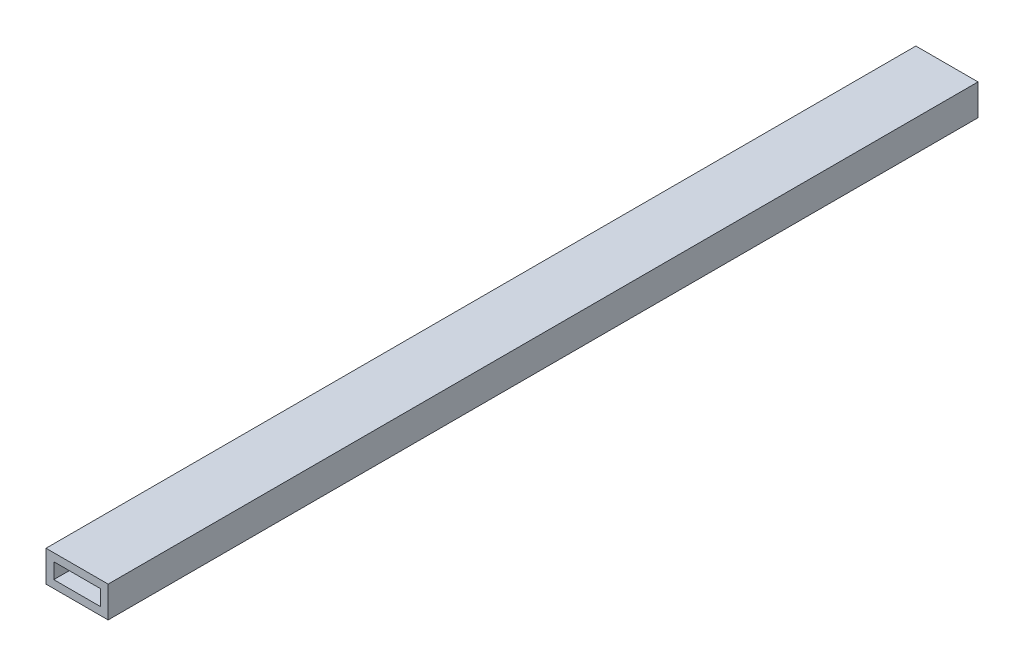
ISO-10303-21;
HEADER;
FILE_DESCRIPTION(('STEP AP214'),'2;1');
FILE_NAME('part.step','',(''),(''),'','','');
FILE_SCHEMA(('AUTOMOTIVE_DESIGN { 1 0 10303 214 1 1 1 1 }'));
ENDSEC;
DATA;
#1=APPLICATION_CONTEXT('core data for automotive mechanical design processes');
#2=APPLICATION_PROTOCOL_DEFINITION('international standard','automotive_design',2000,#1);
#3=PRODUCT_CONTEXT('',#1,'mechanical');
#4=PRODUCT('Part','Part','',(#3));
#5=PRODUCT_RELATED_PRODUCT_CATEGORY('part','',(#4));
#6=PRODUCT_DEFINITION_FORMATION('','',#4);
#7=PRODUCT_DEFINITION_CONTEXT('part definition',#1,'design');
#8=PRODUCT_DEFINITION('design','',#6,#7);
#9=PRODUCT_DEFINITION_SHAPE('','',#8);
#10=(LENGTH_UNIT() NAMED_UNIT(*) SI_UNIT(.MILLI.,.METRE.));
#11=(NAMED_UNIT(*) PLANE_ANGLE_UNIT() SI_UNIT($,.RADIAN.));
#12=(NAMED_UNIT(*) SI_UNIT($,.STERADIAN.) SOLID_ANGLE_UNIT());
#13=UNCERTAINTY_MEASURE_WITH_UNIT(LENGTH_MEASURE(1.E-05),#10,'distance_accuracy_value','');
#14=(GEOMETRIC_REPRESENTATION_CONTEXT(3) GLOBAL_UNCERTAINTY_ASSIGNED_CONTEXT((#13)) GLOBAL_UNIT_ASSIGNED_CONTEXT((#10,
#11,#12)) REPRESENTATION_CONTEXT('',''));
#15=CARTESIAN_POINT('',(0.,0.,0.));
#16=DIRECTION('',(0.,0.,1.));
#17=DIRECTION('',(1.,0.,0.));
#18=AXIS2_PLACEMENT_3D('',#15,#16,#17);
#19=CARTESIAN_POINT('',(0.,0.,355.6));
#20=DIRECTION('',(0.,0.,-1.));
#21=DIRECTION('',(-1.,0.,0.));
#22=AXIS2_PLACEMENT_3D('',#19,#20,#21);
#23=PLANE('',#22);
#24=DIRECTION('',(0.,-1.,0.));
#25=VECTOR('',#24,1.);
#26=CARTESIAN_POINT('',(0.,0.,355.6));
#27=LINE('',#26,#25);
#28=CARTESIAN_POINT('',(0.,12.7,355.6));
#29=VERTEX_POINT('',#28);
#30=CARTESIAN_POINT('',(0.,0.,355.6));
#31=VERTEX_POINT('',#30);
#32=EDGE_CURVE('E164',#29,#31,#27,.T.);
#33=ORIENTED_EDGE('',*,*,#32,.T.);
#34=DIRECTION('',(1.,0.,0.));
#35=VECTOR('',#34,1.);
#36=CARTESIAN_POINT('',(0.,0.,355.6));
#37=LINE('',#36,#35);
#38=CARTESIAN_POINT('',(25.4,0.,355.6));
#39=VERTEX_POINT('',#38);
#40=EDGE_CURVE('E168',#31,#39,#37,.T.);
#41=ORIENTED_EDGE('',*,*,#40,.T.);
#42=DIRECTION('',(0.,1.,0.));
#43=VECTOR('',#42,1.);
#44=CARTESIAN_POINT('',(25.4,0.,355.6));
#45=LINE('',#44,#43);
#46=CARTESIAN_POINT('',(25.4,12.7,355.6));
#47=VERTEX_POINT('',#46);
#48=EDGE_CURVE('E172',#39,#47,#45,.T.);
#49=ORIENTED_EDGE('',*,*,#48,.T.);
#50=DIRECTION('',(-1.,0.,0.));
#51=VECTOR('',#50,1.);
#52=CARTESIAN_POINT('',(0.,12.7,355.6));
#53=LINE('',#52,#51);
#54=EDGE_CURVE('E174',#47,#29,#53,.T.);
#55=ORIENTED_EDGE('',*,*,#54,.T.);
#56=EDGE_LOOP('',(#33,#41,#49,#55));
#57=FACE_BOUND('',#56,.T.);
#58=DIRECTION('',(0.,-1.,0.));
#59=VECTOR('',#58,1.);
#60=CARTESIAN_POINT('',(3.175,3.175,355.6));
#61=LINE('',#60,#59);
#62=CARTESIAN_POINT('',(3.175,9.525,355.6));
#63=VERTEX_POINT('',#62);
#64=CARTESIAN_POINT('',(3.175,3.175,355.6));
#65=VERTEX_POINT('',#64);
#66=EDGE_CURVE('E116',#63,#65,#61,.T.);
#67=ORIENTED_EDGE('',*,*,#66,.F.);
#68=DIRECTION('',(-1.,0.,0.));
#69=VECTOR('',#68,1.);
#70=CARTESIAN_POINT('',(3.175,9.525,355.6));
#71=LINE('',#70,#69);
#72=CARTESIAN_POINT('',(22.225,9.525,355.6));
#73=VERTEX_POINT('',#72);
#74=EDGE_CURVE('E142',#73,#63,#71,.T.);
#75=ORIENTED_EDGE('',*,*,#74,.F.);
#76=DIRECTION('',(0.,1.,0.));
#77=VECTOR('',#76,1.);
#78=CARTESIAN_POINT('',(22.225,3.175,355.6));
#79=LINE('',#78,#77);
#80=CARTESIAN_POINT('',(22.225,3.175,355.6));
#81=VERTEX_POINT('',#80);
#82=EDGE_CURVE('E138',#81,#73,#79,.T.);
#83=ORIENTED_EDGE('',*,*,#82,.F.);
#84=DIRECTION('',(1.,0.,0.));
#85=VECTOR('',#84,1.);
#86=CARTESIAN_POINT('',(3.175,3.175,355.6));
#87=LINE('',#86,#85);
#88=EDGE_CURVE('E125',#65,#81,#87,.T.);
#89=ORIENTED_EDGE('',*,*,#88,.F.);
#90=EDGE_LOOP('',(#67,#75,#83,#89));
#91=FACE_BOUND('',#90,.T.);
#92=ADVANCED_FACE('F38',(#57,#91),#23,.F.);
#93=CARTESIAN_POINT('',(0.,0.,0.));
#94=DIRECTION('',(0.,0.,-1.));
#95=DIRECTION('',(-1.,0.,0.));
#96=AXIS2_PLACEMENT_3D('',#93,#94,#95);
#97=PLANE('',#96);
#98=DIRECTION('',(0.,-1.,0.));
#99=VECTOR('',#98,1.);
#100=CARTESIAN_POINT('',(0.,0.,0.));
#101=LINE('',#100,#99);
#102=CARTESIAN_POINT('',(0.,12.7,0.));
#103=VERTEX_POINT('',#102);
#104=CARTESIAN_POINT('',(0.,0.,0.));
#105=VERTEX_POINT('',#104);
#106=EDGE_CURVE('E134',#103,#105,#101,.T.);
#107=ORIENTED_EDGE('',*,*,#106,.F.);
#108=DIRECTION('',(-1.,0.,0.));
#109=VECTOR('',#108,1.);
#110=CARTESIAN_POINT('',(0.,12.7,0.));
#111=LINE('',#110,#109);
#112=CARTESIAN_POINT('',(25.4,12.7,0.));
#113=VERTEX_POINT('',#112);
#114=EDGE_CURVE('E169',#113,#103,#111,.T.);
#115=ORIENTED_EDGE('',*,*,#114,.F.);
#116=DIRECTION('',(0.,1.,0.));
#117=VECTOR('',#116,1.);
#118=CARTESIAN_POINT('',(25.4,0.,0.));
#119=LINE('',#118,#117);
#120=CARTESIAN_POINT('',(25.4,0.,0.));
#121=VERTEX_POINT('',#120);
#122=EDGE_CURVE('E184',#121,#113,#119,.T.);
#123=ORIENTED_EDGE('',*,*,#122,.F.);
#124=DIRECTION('',(1.,0.,0.));
#125=VECTOR('',#124,1.);
#126=CARTESIAN_POINT('',(0.,0.,0.));
#127=LINE('',#126,#125);
#128=EDGE_CURVE('E181',#105,#121,#127,.T.);
#129=ORIENTED_EDGE('',*,*,#128,.F.);
#130=EDGE_LOOP('',(#107,#115,#123,#129));
#131=FACE_BOUND('',#130,.T.);
#132=DIRECTION('',(-1.,0.,0.));
#133=VECTOR('',#132,1.);
#134=CARTESIAN_POINT('',(3.175,9.525,0.));
#135=LINE('',#134,#133);
#136=CARTESIAN_POINT('',(22.225,9.525,0.));
#137=VERTEX_POINT('',#136);
#138=CARTESIAN_POINT('',(3.175,9.525,0.));
#139=VERTEX_POINT('',#138);
#140=EDGE_CURVE('E126',#137,#139,#135,.T.);
#141=ORIENTED_EDGE('',*,*,#140,.T.);
#142=DIRECTION('',(0.,-1.,0.));
#143=VECTOR('',#142,1.);
#144=CARTESIAN_POINT('',(3.175,3.175,0.));
#145=LINE('',#144,#143);
#146=CARTESIAN_POINT('',(3.175,3.175,0.));
#147=VERTEX_POINT('',#146);
#148=EDGE_CURVE('E65',#139,#147,#145,.T.);
#149=ORIENTED_EDGE('',*,*,#148,.T.);
#150=DIRECTION('',(1.,0.,0.));
#151=VECTOR('',#150,1.);
#152=CARTESIAN_POINT('',(3.175,3.175,0.));
#153=LINE('',#152,#151);
#154=CARTESIAN_POINT('',(22.225,3.175,0.));
#155=VERTEX_POINT('',#154);
#156=EDGE_CURVE('E132',#147,#155,#153,.T.);
#157=ORIENTED_EDGE('',*,*,#156,.T.);
#158=DIRECTION('',(0.,1.,0.));
#159=VECTOR('',#158,1.);
#160=CARTESIAN_POINT('',(22.225,3.175,0.));
#161=LINE('',#160,#159);
#162=EDGE_CURVE('E151',#155,#137,#161,.T.);
#163=ORIENTED_EDGE('',*,*,#162,.T.);
#164=EDGE_LOOP('',(#141,#149,#157,#163));
#165=FACE_BOUND('',#164,.T.);
#166=ADVANCED_FACE('F207',(#131,#165),#97,.T.);
#167=CARTESIAN_POINT('',(0.,0.,355.6));
#168=DIRECTION('',(1.,0.,0.));
#169=DIRECTION('',(0.,0.,-1.));
#170=AXIS2_PLACEMENT_3D('',#167,#168,#169);
#171=PLANE('',#170);
#172=ORIENTED_EDGE('',*,*,#106,.T.);
#173=DIRECTION('',(0.,0.,-1.));
#174=VECTOR('',#173,1.);
#175=CARTESIAN_POINT('',(0.,0.,355.6));
#176=LINE('',#175,#174);
#177=EDGE_CURVE('E11',#31,#105,#176,.T.);
#178=ORIENTED_EDGE('',*,*,#177,.F.);
#179=ORIENTED_EDGE('',*,*,#32,.F.);
#180=DIRECTION('',(0.,0.,-1.));
#181=VECTOR('',#180,1.);
#182=CARTESIAN_POINT('',(0.,12.7,355.6));
#183=LINE('',#182,#181);
#184=EDGE_CURVE('E177',#29,#103,#183,.T.);
#185=ORIENTED_EDGE('',*,*,#184,.T.);
#186=EDGE_LOOP('',(#172,#178,#179,#185));
#187=FACE_BOUND('',#186,.T.);
#188=ADVANCED_FACE('F40',(#187),#171,.F.);
#189=CARTESIAN_POINT('',(0.,0.,355.6));
#190=DIRECTION('',(0.,1.,0.));
#191=DIRECTION('',(0.,0.,1.));
#192=AXIS2_PLACEMENT_3D('',#189,#190,#191);
#193=PLANE('',#192);
#194=ORIENTED_EDGE('',*,*,#128,.T.);
#195=DIRECTION('',(0.,0.,-1.));
#196=VECTOR('',#195,1.);
#197=CARTESIAN_POINT('',(25.4,0.,355.6));
#198=LINE('',#197,#196);
#199=EDGE_CURVE('E47',#39,#121,#198,.T.);
#200=ORIENTED_EDGE('',*,*,#199,.F.);
#201=ORIENTED_EDGE('',*,*,#40,.F.);
#202=ORIENTED_EDGE('',*,*,#177,.T.);
#203=EDGE_LOOP('',(#194,#200,#201,#202));
#204=FACE_BOUND('',#203,.T.);
#205=ADVANCED_FACE('F217',(#204),#193,.F.);
#206=CARTESIAN_POINT('',(25.4,0.,355.6));
#207=DIRECTION('',(-1.,0.,0.));
#208=DIRECTION('',(0.,0.,1.));
#209=AXIS2_PLACEMENT_3D('',#206,#207,#208);
#210=PLANE('',#209);
#211=ORIENTED_EDGE('',*,*,#122,.T.);
#212=DIRECTION('',(0.,0.,-1.));
#213=VECTOR('',#212,1.);
#214=CARTESIAN_POINT('',(25.4,12.7,355.6));
#215=LINE('',#214,#213);
#216=EDGE_CURVE('E192',#47,#113,#215,.T.);
#217=ORIENTED_EDGE('',*,*,#216,.F.);
#218=ORIENTED_EDGE('',*,*,#48,.F.);
#219=ORIENTED_EDGE('',*,*,#199,.T.);
#220=EDGE_LOOP('',(#211,#217,#218,#219));
#221=FACE_BOUND('',#220,.T.);
#222=ADVANCED_FACE('F201',(#221),#210,.F.);
#223=CARTESIAN_POINT('',(0.,12.7,355.6));
#224=DIRECTION('',(0.,-1.,0.));
#225=DIRECTION('',(0.,0.,-1.));
#226=AXIS2_PLACEMENT_3D('',#223,#224,#225);
#227=PLANE('',#226);
#228=ORIENTED_EDGE('',*,*,#114,.T.);
#229=ORIENTED_EDGE('',*,*,#184,.F.);
#230=ORIENTED_EDGE('',*,*,#54,.F.);
#231=ORIENTED_EDGE('',*,*,#216,.T.);
#232=EDGE_LOOP('',(#228,#229,#230,#231));
#233=FACE_BOUND('',#232,.T.);
#234=ADVANCED_FACE('F211',(#233),#227,.F.);
#235=CARTESIAN_POINT('',(3.175,3.175,355.6));
#236=DIRECTION('',(1.,0.,0.));
#237=DIRECTION('',(0.,0.,-1.));
#238=AXIS2_PLACEMENT_3D('',#235,#236,#237);
#239=PLANE('',#238);
#240=ORIENTED_EDGE('',*,*,#148,.F.);
#241=DIRECTION('',(0.,0.,-1.));
#242=VECTOR('',#241,1.);
#243=CARTESIAN_POINT('',(3.175,9.525,355.6));
#244=LINE('',#243,#242);
#245=EDGE_CURVE('E120',#63,#139,#244,.T.);
#246=ORIENTED_EDGE('',*,*,#245,.F.);
#247=ORIENTED_EDGE('',*,*,#66,.T.);
#248=DIRECTION('',(0.,0.,-1.));
#249=VECTOR('',#248,1.);
#250=CARTESIAN_POINT('',(3.175,3.175,355.6));
#251=LINE('',#250,#249);
#252=EDGE_CURVE('E119',#65,#147,#251,.T.);
#253=ORIENTED_EDGE('',*,*,#252,.T.);
#254=EDGE_LOOP('',(#240,#246,#247,#253));
#255=FACE_BOUND('',#254,.T.);
#256=ADVANCED_FACE('F118',(#255),#239,.T.);
#257=CARTESIAN_POINT('',(3.175,3.175,355.6));
#258=DIRECTION('',(0.,1.,0.));
#259=DIRECTION('',(0.,0.,1.));
#260=AXIS2_PLACEMENT_3D('',#257,#258,#259);
#261=PLANE('',#260);
#262=ORIENTED_EDGE('',*,*,#156,.F.);
#263=ORIENTED_EDGE('',*,*,#252,.F.);
#264=ORIENTED_EDGE('',*,*,#88,.T.);
#265=DIRECTION('',(0.,0.,-1.));
#266=VECTOR('',#265,1.);
#267=CARTESIAN_POINT('',(22.225,3.175,355.6));
#268=LINE('',#267,#266);
#269=EDGE_CURVE('E135',#81,#155,#268,.T.);
#270=ORIENTED_EDGE('',*,*,#269,.T.);
#271=EDGE_LOOP('',(#262,#263,#264,#270));
#272=FACE_BOUND('',#271,.T.);
#273=ADVANCED_FACE('F129',(#272),#261,.T.);
#274=CARTESIAN_POINT('',(22.225,3.175,355.6));
#275=DIRECTION('',(-1.,0.,0.));
#276=DIRECTION('',(0.,0.,1.));
#277=AXIS2_PLACEMENT_3D('',#274,#275,#276);
#278=PLANE('',#277);
#279=ORIENTED_EDGE('',*,*,#162,.F.);
#280=ORIENTED_EDGE('',*,*,#269,.F.);
#281=ORIENTED_EDGE('',*,*,#82,.T.);
#282=DIRECTION('',(0.,0.,-1.));
#283=VECTOR('',#282,1.);
#284=CARTESIAN_POINT('',(22.225,9.525,355.6));
#285=LINE('',#284,#283);
#286=EDGE_CURVE('E54',#73,#137,#285,.T.);
#287=ORIENTED_EDGE('',*,*,#286,.T.);
#288=EDGE_LOOP('',(#279,#280,#281,#287));
#289=FACE_BOUND('',#288,.T.);
#290=ADVANCED_FACE('F240',(#289),#278,.T.);
#291=CARTESIAN_POINT('',(3.175,9.525,355.6));
#292=DIRECTION('',(0.,-1.,0.));
#293=DIRECTION('',(0.,0.,-1.));
#294=AXIS2_PLACEMENT_3D('',#291,#292,#293);
#295=PLANE('',#294);
#296=ORIENTED_EDGE('',*,*,#140,.F.);
#297=ORIENTED_EDGE('',*,*,#286,.F.);
#298=ORIENTED_EDGE('',*,*,#74,.T.);
#299=ORIENTED_EDGE('',*,*,#245,.T.);
#300=EDGE_LOOP('',(#296,#297,#298,#299));
#301=FACE_BOUND('',#300,.T.);
#302=ADVANCED_FACE('F244',(#301),#295,.T.);
#303=CLOSED_SHELL('',(#92,#166,#188,#205,#222,#234,#256,#273,#290,#302));
#304=MANIFOLD_SOLID_BREP('B2',#303);
#305=ADVANCED_BREP_SHAPE_REPRESENTATION('',(#18,#304),#14);
#306=SHAPE_DEFINITION_REPRESENTATION(#9,#305);
ENDSEC;
END-ISO-10303-21;
